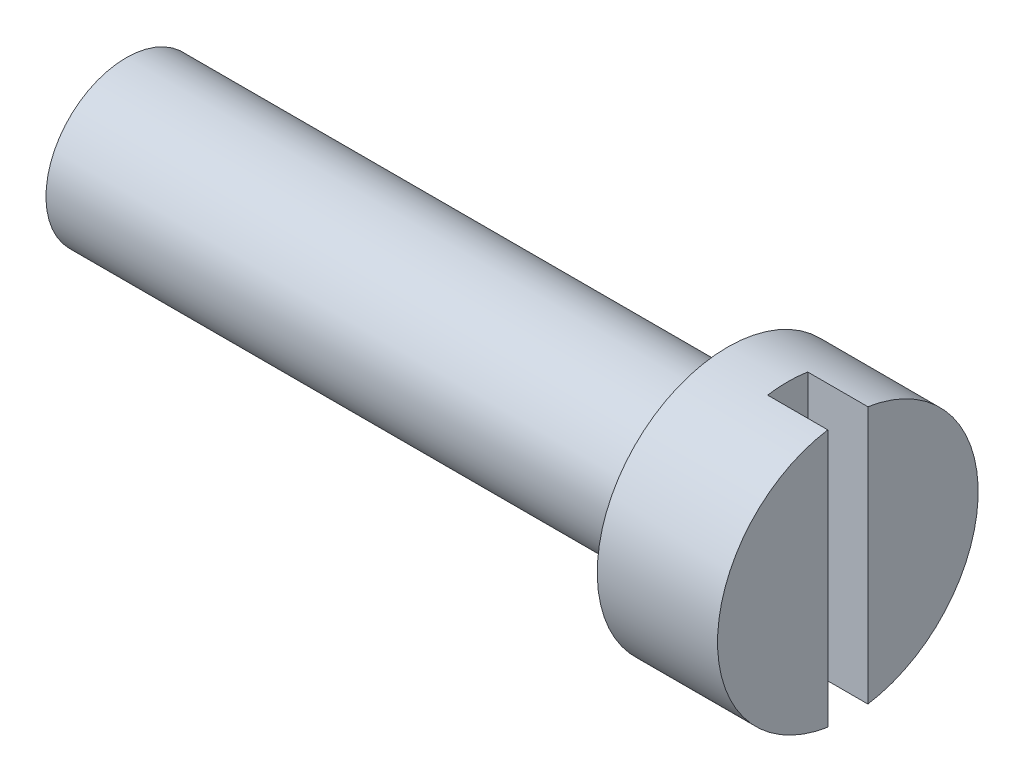
ISO-10303-21;
HEADER;
FILE_DESCRIPTION(('STEP AP214'),'2;1');
FILE_NAME('part.step','',(''),(''),'','','');
FILE_SCHEMA(('AUTOMOTIVE_DESIGN { 1 0 10303 214 1 1 1 1 }'));
ENDSEC;
DATA;
#1=APPLICATION_CONTEXT('core data for automotive mechanical design processes');
#2=APPLICATION_PROTOCOL_DEFINITION('international standard','automotive_design',2000,#1);
#3=PRODUCT_CONTEXT('',#1,'mechanical');
#4=PRODUCT('Part','Part','',(#3));
#5=PRODUCT_RELATED_PRODUCT_CATEGORY('part','',(#4));
#6=PRODUCT_DEFINITION_FORMATION('','',#4);
#7=PRODUCT_DEFINITION_CONTEXT('part definition',#1,'design');
#8=PRODUCT_DEFINITION('design','',#6,#7);
#9=PRODUCT_DEFINITION_SHAPE('','',#8);
#10=(LENGTH_UNIT() NAMED_UNIT(*) SI_UNIT(.MILLI.,.METRE.));
#11=(NAMED_UNIT(*) PLANE_ANGLE_UNIT() SI_UNIT($,.RADIAN.));
#12=(NAMED_UNIT(*) SI_UNIT($,.STERADIAN.) SOLID_ANGLE_UNIT());
#13=UNCERTAINTY_MEASURE_WITH_UNIT(LENGTH_MEASURE(1.E-05),#10,'distance_accuracy_value','');
#14=(GEOMETRIC_REPRESENTATION_CONTEXT(3) GLOBAL_UNCERTAINTY_ASSIGNED_CONTEXT((#13)) GLOBAL_UNIT_ASSIGNED_CONTEXT((#10,
#11,#12)) REPRESENTATION_CONTEXT('',''));
#15=CARTESIAN_POINT('',(0.,0.,0.));
#16=DIRECTION('',(0.,0.,1.));
#17=DIRECTION('',(1.,0.,0.));
#18=AXIS2_PLACEMENT_3D('',#15,#16,#17);
#19=CARTESIAN_POINT('',(0.,3.25,0.));
#20=DIRECTION('',(1.,0.,0.));
#21=DIRECTION('',(0.,1.,0.));
#22=AXIS2_PLACEMENT_3D('',#19,#20,#21);
#23=PLANE('',#22);
#24=DIRECTION('',(0.,1.,0.));
#25=VECTOR('',#24,1.);
#26=CARTESIAN_POINT('',(0.,-3.25,-0.5));
#27=LINE('',#26,#25);
#28=CARTESIAN_POINT('',(0.,-3.21130814466628,-0.5));
#29=VERTEX_POINT('',#28);
#30=CARTESIAN_POINT('',(0.,3.21130814466628,-0.5));
#31=VERTEX_POINT('',#30);
#32=EDGE_CURVE('E88',#29,#31,#27,.T.);
#33=ORIENTED_EDGE('',*,*,#32,.F.);
#34=CARTESIAN_POINT('',(0.,0.,0.));
#35=DIRECTION('',(1.,0.,0.));
#36=DIRECTION('',(0.,1.,0.));
#37=AXIS2_PLACEMENT_3D('',#34,#35,#36);
#38=CIRCLE('',#37,3.25);
#39=EDGE_CURVE('E99',#29,#31,#38,.T.);
#40=ORIENTED_EDGE('',*,*,#39,.T.);
#41=EDGE_LOOP('',(#33,#40));
#42=FACE_BOUND('',#41,.T.);
#43=ADVANCED_FACE('F45',(#42),#23,.T.);
#44=DIRECTION('',(0.,-1.,0.));
#45=VECTOR('',#44,1.);
#46=CARTESIAN_POINT('',(0.,-3.25,0.5));
#47=LINE('',#46,#45);
#48=CARTESIAN_POINT('',(0.,3.21130814466628,0.5));
#49=VERTEX_POINT('',#48);
#50=CARTESIAN_POINT('',(0.,-3.21130814466628,0.5));
#51=VERTEX_POINT('',#50);
#52=EDGE_CURVE('E101',#49,#51,#47,.T.);
#53=ORIENTED_EDGE('',*,*,#52,.F.);
#54=EDGE_CURVE('E106',#49,#51,#38,.T.);
#55=ORIENTED_EDGE('',*,*,#54,.T.);
#56=EDGE_LOOP('',(#53,#55));
#57=FACE_BOUND('',#56,.T.);
#58=ADVANCED_FACE('F47',(#57),#23,.T.);
#59=CARTESIAN_POINT('',(-18.,0.,0.));
#60=DIRECTION('',(-1.,0.,0.));
#61=DIRECTION('',(0.,-1.,0.));
#62=AXIS2_PLACEMENT_3D('',#59,#60,#61);
#63=PLANE('',#62);
#64=CARTESIAN_POINT('',(-18.,0.,0.));
#65=DIRECTION('',(1.,0.,0.));
#66=DIRECTION('',(0.,1.,0.));
#67=AXIS2_PLACEMENT_3D('',#64,#65,#66);
#68=CIRCLE('',#67,2.);
#69=CARTESIAN_POINT('',(-18.,2.,0.));
#70=VERTEX_POINT('',#69);
#71=EDGE_CURVE('E122',#70,#70,#68,.T.);
#72=ORIENTED_EDGE('',*,*,#71,.F.);
#73=EDGE_LOOP('',(#72));
#74=FACE_BOUND('',#73,.T.);
#75=ADVANCED_FACE('F154',(#74),#63,.T.);
#76=CARTESIAN_POINT('',(0.,0.,0.));
#77=DIRECTION('',(1.,0.,0.));
#78=DIRECTION('',(0.,1.,0.));
#79=AXIS2_PLACEMENT_3D('',#76,#77,#78);
#80=CYLINDRICAL_SURFACE('',#79,2.);
#81=ORIENTED_EDGE('',*,*,#71,.T.);
#82=EDGE_LOOP('',(#81));
#83=FACE_BOUND('',#82,.T.);
#84=CARTESIAN_POINT('',(-3.,0.,0.));
#85=DIRECTION('',(1.,0.,0.));
#86=DIRECTION('',(0.,1.,0.));
#87=AXIS2_PLACEMENT_3D('',#84,#85,#86);
#88=CIRCLE('',#87,2.);
#89=CARTESIAN_POINT('',(-3.,2.,0.));
#90=VERTEX_POINT('',#89);
#91=EDGE_CURVE('E118',#90,#90,#88,.T.);
#92=ORIENTED_EDGE('',*,*,#91,.F.);
#93=EDGE_LOOP('',(#92));
#94=FACE_BOUND('',#93,.T.);
#95=ADVANCED_FACE('F159',(#83,#94),#80,.T.);
#96=CARTESIAN_POINT('',(-3.,2.,0.));
#97=DIRECTION('',(-1.,0.,0.));
#98=DIRECTION('',(0.,-1.,0.));
#99=AXIS2_PLACEMENT_3D('',#96,#97,#98);
#100=PLANE('',#99);
#101=ORIENTED_EDGE('',*,*,#91,.T.);
#102=EDGE_LOOP('',(#101));
#103=FACE_BOUND('',#102,.T.);
#104=CARTESIAN_POINT('',(-3.,0.,0.));
#105=DIRECTION('',(1.,0.,0.));
#106=DIRECTION('',(0.,1.,0.));
#107=AXIS2_PLACEMENT_3D('',#104,#105,#106);
#108=CIRCLE('',#107,3.25);
#109=CARTESIAN_POINT('',(-3.,3.25,0.));
#110=VERTEX_POINT('',#109);
#111=EDGE_CURVE('E111',#110,#110,#108,.T.);
#112=ORIENTED_EDGE('',*,*,#111,.F.);
#113=EDGE_LOOP('',(#112));
#114=FACE_BOUND('',#113,.T.);
#115=ADVANCED_FACE('F164',(#103,#114),#100,.T.);
#116=CARTESIAN_POINT('',(0.,0.,0.));
#117=DIRECTION('',(1.,0.,0.));
#118=DIRECTION('',(0.,1.,0.));
#119=AXIS2_PLACEMENT_3D('',#116,#117,#118);
#120=CYLINDRICAL_SURFACE('',#119,3.25);
#121=DIRECTION('',(1.,0.,0.));
#122=VECTOR('',#121,1.);
#123=CARTESIAN_POINT('',(0.,3.21130814466628,-0.5));
#124=LINE('',#123,#122);
#125=CARTESIAN_POINT('',(-1.5,3.21130814466628,-0.5));
#126=VERTEX_POINT('',#125);
#127=EDGE_CURVE('E11',#31,#126,#124,.F.);
#128=ORIENTED_EDGE('',*,*,#127,.F.);
#129=ORIENTED_EDGE('',*,*,#39,.F.);
#130=DIRECTION('',(1.,0.,0.));
#131=VECTOR('',#130,1.);
#132=CARTESIAN_POINT('',(0.,-3.21130814466628,-0.5));
#133=LINE('',#132,#131);
#134=CARTESIAN_POINT('',(-1.5,-3.21130814466628,-0.5));
#135=VERTEX_POINT('',#134);
#136=EDGE_CURVE('E85',#135,#29,#133,.T.);
#137=ORIENTED_EDGE('',*,*,#136,.F.);
#138=CARTESIAN_POINT('',(-1.5,0.,0.));
#139=DIRECTION('',(-1.,0.,0.));
#140=DIRECTION('',(0.,-1.,0.));
#141=AXIS2_PLACEMENT_3D('',#138,#139,#140);
#142=CIRCLE('',#141,3.25);
#143=CARTESIAN_POINT('',(-1.5,-3.21130814466628,0.5));
#144=VERTEX_POINT('',#143);
#145=EDGE_CURVE('E126',#144,#135,#142,.F.);
#146=ORIENTED_EDGE('',*,*,#145,.F.);
#147=DIRECTION('',(1.,0.,0.));
#148=VECTOR('',#147,1.);
#149=CARTESIAN_POINT('',(0.,-3.21130814466628,0.5));
#150=LINE('',#149,#148);
#151=EDGE_CURVE('E95',#51,#144,#150,.F.);
#152=ORIENTED_EDGE('',*,*,#151,.F.);
#153=ORIENTED_EDGE('',*,*,#54,.F.);
#154=DIRECTION('',(1.,0.,0.));
#155=VECTOR('',#154,1.);
#156=CARTESIAN_POINT('',(0.,3.21130814466628,0.5));
#157=LINE('',#156,#155);
#158=CARTESIAN_POINT('',(-1.5,3.21130814466628,0.5));
#159=VERTEX_POINT('',#158);
#160=EDGE_CURVE('E54',#159,#49,#157,.T.);
#161=ORIENTED_EDGE('',*,*,#160,.F.);
#162=EDGE_CURVE('E66',#126,#159,#142,.F.);
#163=ORIENTED_EDGE('',*,*,#162,.F.);
#164=EDGE_LOOP('',(#128,#129,#137,#146,#152,#153,#161,#163));
#165=FACE_BOUND('',#164,.T.);
#166=ORIENTED_EDGE('',*,*,#111,.T.);
#167=EDGE_LOOP('',(#166));
#168=FACE_BOUND('',#167,.T.);
#169=ADVANCED_FACE('F103',(#165,#168),#120,.T.);
#170=CARTESIAN_POINT('',(-1.5,-3.25,-0.5));
#171=DIRECTION('',(0.,0.,-1.));
#172=DIRECTION('',(-1.,0.,0.));
#173=AXIS2_PLACEMENT_3D('',#170,#171,#172);
#174=PLANE('',#173);
#175=ORIENTED_EDGE('',*,*,#127,.T.);
#176=DIRECTION('',(0.,1.,0.));
#177=VECTOR('',#176,1.);
#178=CARTESIAN_POINT('',(-1.5,-3.25,-0.5));
#179=LINE('',#178,#177);
#180=EDGE_CURVE('E90',#135,#126,#179,.T.);
#181=ORIENTED_EDGE('',*,*,#180,.F.);
#182=ORIENTED_EDGE('',*,*,#136,.T.);
#183=ORIENTED_EDGE('',*,*,#32,.T.);
#184=EDGE_LOOP('',(#175,#181,#182,#183));
#185=FACE_BOUND('',#184,.T.);
#186=ADVANCED_FACE('F87',(#185),#174,.F.);
#187=CARTESIAN_POINT('',(-1.5,-3.25,0.5));
#188=DIRECTION('',(0.,0.,1.));
#189=DIRECTION('',(1.,0.,0.));
#190=AXIS2_PLACEMENT_3D('',#187,#188,#189);
#191=PLANE('',#190);
#192=ORIENTED_EDGE('',*,*,#151,.T.);
#193=DIRECTION('',(0.,-1.,0.));
#194=VECTOR('',#193,1.);
#195=CARTESIAN_POINT('',(-1.5,-3.25,0.5));
#196=LINE('',#195,#194);
#197=EDGE_CURVE('E61',#159,#144,#196,.T.);
#198=ORIENTED_EDGE('',*,*,#197,.F.);
#199=ORIENTED_EDGE('',*,*,#160,.T.);
#200=ORIENTED_EDGE('',*,*,#52,.T.);
#201=EDGE_LOOP('',(#192,#198,#199,#200));
#202=FACE_BOUND('',#201,.T.);
#203=ADVANCED_FACE('F135',(#202),#191,.F.);
#204=CARTESIAN_POINT('',(-1.5,0.,0.));
#205=DIRECTION('',(-1.,0.,0.));
#206=DIRECTION('',(0.,-1.,0.));
#207=AXIS2_PLACEMENT_3D('',#204,#205,#206);
#208=PLANE('',#207);
#209=ORIENTED_EDGE('',*,*,#180,.T.);
#210=ORIENTED_EDGE('',*,*,#162,.T.);
#211=ORIENTED_EDGE('',*,*,#197,.T.);
#212=ORIENTED_EDGE('',*,*,#145,.T.);
#213=EDGE_LOOP('',(#209,#210,#211,#212));
#214=FACE_BOUND('',#213,.T.);
#215=ADVANCED_FACE('F140',(#214),#208,.F.);
#216=CLOSED_SHELL('',(#43,#58,#75,#95,#115,#169,#186,#203,#215));
#217=MANIFOLD_SOLID_BREP('B2',#216);
#218=ADVANCED_BREP_SHAPE_REPRESENTATION('',(#18,#217),#14);
#219=SHAPE_DEFINITION_REPRESENTATION(#9,#218);
ENDSEC;
END-ISO-10303-21;
